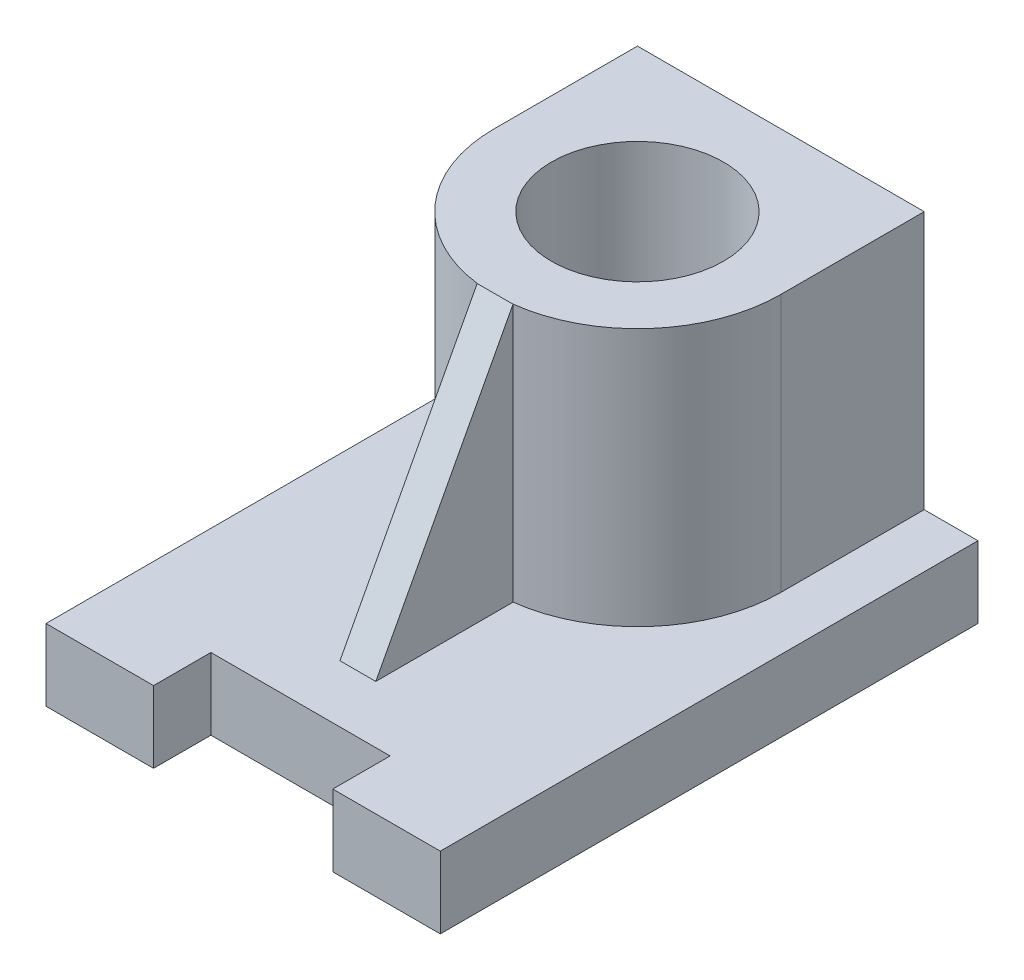
ISO-10303-21;
HEADER;
FILE_DESCRIPTION(('STEP AP214'),'2;1');
FILE_NAME('part.step','',(''),(''),'','','');
FILE_SCHEMA(('AUTOMOTIVE_DESIGN { 1 0 10303 214 1 1 1 1 }'));
ENDSEC;
DATA;
#1=APPLICATION_CONTEXT('core data for automotive mechanical design processes');
#2=APPLICATION_PROTOCOL_DEFINITION('international standard','automotive_design',2000,#1);
#3=PRODUCT_CONTEXT('',#1,'mechanical');
#4=PRODUCT('Part','Part','',(#3));
#5=PRODUCT_RELATED_PRODUCT_CATEGORY('part','',(#4));
#6=PRODUCT_DEFINITION_FORMATION('','',#4);
#7=PRODUCT_DEFINITION_CONTEXT('part definition',#1,'design');
#8=PRODUCT_DEFINITION('design','',#6,#7);
#9=PRODUCT_DEFINITION_SHAPE('','',#8);
#10=(LENGTH_UNIT() NAMED_UNIT(*) SI_UNIT(.MILLI.,.METRE.));
#11=(NAMED_UNIT(*) PLANE_ANGLE_UNIT() SI_UNIT($,.RADIAN.));
#12=(NAMED_UNIT(*) SI_UNIT($,.STERADIAN.) SOLID_ANGLE_UNIT());
#13=UNCERTAINTY_MEASURE_WITH_UNIT(LENGTH_MEASURE(1.E-05),#10,'distance_accuracy_value','');
#14=(GEOMETRIC_REPRESENTATION_CONTEXT(3) GLOBAL_UNCERTAINTY_ASSIGNED_CONTEXT((#13)) GLOBAL_UNIT_ASSIGNED_CONTEXT((#10,
#11,#12)) REPRESENTATION_CONTEXT('',''));
#15=CARTESIAN_POINT('',(0.,0.,0.));
#16=DIRECTION('',(0.,0.,1.));
#17=DIRECTION('',(1.,0.,0.));
#18=AXIS2_PLACEMENT_3D('',#15,#16,#17);
#19=CARTESIAN_POINT('',(0.,20.,-75.));
#20=DIRECTION('',(0.,1.,0.));
#21=DIRECTION('',(1.,0.,0.));
#22=AXIS2_PLACEMENT_3D('',#19,#20,#21);
#23=PLANE('',#22);
#24=DIRECTION('',(0.,0.,-1.));
#25=VECTOR('',#24,1.);
#26=CARTESIAN_POINT('',(40.,20.,-75.));
#27=LINE('',#26,#25);
#28=CARTESIAN_POINT('',(40.,20.,-110.));
#29=VERTEX_POINT('',#28);
#30=CARTESIAN_POINT('',(40.,20.,-150.));
#31=VERTEX_POINT('',#30);
#32=EDGE_CURVE('E10',#29,#31,#27,.T.);
#33=ORIENTED_EDGE('',*,*,#32,.F.);
#34=CARTESIAN_POINT('',(0.,20.,-110.));
#35=DIRECTION('',(0.,1.,0.));
#36=DIRECTION('',(1.,0.,0.));
#37=AXIS2_PLACEMENT_3D('',#34,#35,#36);
#38=CIRCLE('',#37,40.);
#39=CARTESIAN_POINT('',(5.,20.,-70.3137303340311));
#40=VERTEX_POINT('',#39);
#41=EDGE_CURVE('E24',#29,#40,#38,.F.);
#42=ORIENTED_EDGE('',*,*,#41,.T.);
#43=DIRECTION('',(0.,0.,-1.));
#44=VECTOR('',#43,1.);
#45=CARTESIAN_POINT('',(5.,20.,-75.));
#46=LINE('',#45,#44);
#47=CARTESIAN_POINT('',(5.,20.,-32.));
#48=VERTEX_POINT('',#47);
#49=EDGE_CURVE('E300',#48,#40,#46,.T.);
#50=ORIENTED_EDGE('',*,*,#49,.F.);
#51=DIRECTION('',(1.,0.,0.));
#52=VECTOR('',#51,1.);
#53=CARTESIAN_POINT('',(0.,20.,-32.));
#54=LINE('',#53,#52);
#55=CARTESIAN_POINT('',(-5.,20.,-32.));
#56=VERTEX_POINT('',#55);
#57=EDGE_CURVE('E297',#48,#56,#54,.F.);
#58=ORIENTED_EDGE('',*,*,#57,.T.);
#59=DIRECTION('',(0.,0.,-1.));
#60=VECTOR('',#59,1.);
#61=CARTESIAN_POINT('',(-5.,20.,-75.));
#62=LINE('',#61,#60);
#63=CARTESIAN_POINT('',(-5.,20.,-70.3137303340311));
#64=VERTEX_POINT('',#63);
#65=EDGE_CURVE('E294',#56,#64,#62,.T.);
#66=ORIENTED_EDGE('',*,*,#65,.T.);
#67=CARTESIAN_POINT('',(-40.,20.,-110.));
#68=VERTEX_POINT('',#67);
#69=EDGE_CURVE('E293',#64,#68,#38,.F.);
#70=ORIENTED_EDGE('',*,*,#69,.T.);
#71=DIRECTION('',(0.,0.,-1.));
#72=VECTOR('',#71,1.);
#73=CARTESIAN_POINT('',(-40.,20.,-75.));
#74=LINE('',#73,#72);
#75=CARTESIAN_POINT('',(-40.,20.,-150.));
#76=VERTEX_POINT('',#75);
#77=EDGE_CURVE('E154',#68,#76,#74,.T.);
#78=ORIENTED_EDGE('',*,*,#77,.T.);
#79=DIRECTION('',(1.,0.,0.));
#80=VECTOR('',#79,1.);
#81=CARTESIAN_POINT('',(47.5,20.,-150.));
#82=LINE('',#81,#80);
#83=CARTESIAN_POINT('',(-55.,20.,-150.));
#84=VERTEX_POINT('',#83);
#85=EDGE_CURVE('E287',#84,#76,#82,.T.);
#86=ORIENTED_EDGE('',*,*,#85,.F.);
#87=DIRECTION('',(0.,0.,1.));
#88=VECTOR('',#87,1.);
#89=CARTESIAN_POINT('',(-55.,20.,-75.));
#90=LINE('',#89,#88);
#91=CARTESIAN_POINT('',(-55.,20.,0.));
#92=VERTEX_POINT('',#91);
#93=EDGE_CURVE('E284',#84,#92,#90,.T.);
#94=ORIENTED_EDGE('',*,*,#93,.T.);
#95=DIRECTION('',(1.,0.,0.));
#96=VECTOR('',#95,1.);
#97=CARTESIAN_POINT('',(-40.,20.,0.));
#98=LINE('',#97,#96);
#99=CARTESIAN_POINT('',(-25.,20.,0.));
#100=VERTEX_POINT('',#99);
#101=EDGE_CURVE('E281',#92,#100,#98,.T.);
#102=ORIENTED_EDGE('',*,*,#101,.T.);
#103=DIRECTION('',(0.,0.,-1.));
#104=VECTOR('',#103,1.);
#105=CARTESIAN_POINT('',(-25.,20.,-8.));
#106=LINE('',#105,#104);
#107=CARTESIAN_POINT('',(-25.,20.,-16.));
#108=VERTEX_POINT('',#107);
#109=EDGE_CURVE('E278',#100,#108,#106,.T.);
#110=ORIENTED_EDGE('',*,*,#109,.T.);
#111=DIRECTION('',(1.,0.,0.));
#112=VECTOR('',#111,1.);
#113=CARTESIAN_POINT('',(0.,20.,-16.));
#114=LINE('',#113,#112);
#115=CARTESIAN_POINT('',(25.,20.,-16.));
#116=VERTEX_POINT('',#115);
#117=EDGE_CURVE('E275',#108,#116,#114,.T.);
#118=ORIENTED_EDGE('',*,*,#117,.T.);
#119=DIRECTION('',(0.,0.,1.));
#120=VECTOR('',#119,1.);
#121=CARTESIAN_POINT('',(25.,20.,-8.));
#122=LINE('',#121,#120);
#123=CARTESIAN_POINT('',(25.,20.,0.));
#124=VERTEX_POINT('',#123);
#125=EDGE_CURVE('E272',#116,#124,#122,.T.);
#126=ORIENTED_EDGE('',*,*,#125,.T.);
#127=DIRECTION('',(1.,0.,0.));
#128=VECTOR('',#127,1.);
#129=CARTESIAN_POINT('',(40.,20.,0.));
#130=LINE('',#129,#128);
#131=CARTESIAN_POINT('',(55.,20.,0.));
#132=VERTEX_POINT('',#131);
#133=EDGE_CURVE('E269',#124,#132,#130,.T.);
#134=ORIENTED_EDGE('',*,*,#133,.T.);
#135=DIRECTION('',(0.,0.,1.));
#136=VECTOR('',#135,1.);
#137=CARTESIAN_POINT('',(55.,20.,-75.));
#138=LINE('',#137,#136);
#139=CARTESIAN_POINT('',(55.,20.,-150.));
#140=VERTEX_POINT('',#139);
#141=EDGE_CURVE('E265',#140,#132,#138,.T.);
#142=ORIENTED_EDGE('',*,*,#141,.F.);
#143=EDGE_CURVE('E264',#31,#140,#82,.T.);
#144=ORIENTED_EDGE('',*,*,#143,.F.);
#145=EDGE_LOOP('',(#33,#42,#50,#58,#66,#70,#78,#86,#94,#102,#110,#118,#126,#134,#142,#144));
#146=FACE_BOUND('',#145,.T.);
#147=ADVANCED_FACE('F16',(#146),#23,.T.);
#148=CARTESIAN_POINT('',(47.5,20.,-150.));
#149=DIRECTION('',(0.,0.,-1.));
#150=DIRECTION('',(0.,1.,0.));
#151=AXIS2_PLACEMENT_3D('',#148,#149,#150);
#152=PLANE('',#151);
#153=DIRECTION('',(0.,-1.,0.));
#154=VECTOR('',#153,1.);
#155=CARTESIAN_POINT('',(55.,20.,-150.));
#156=LINE('',#155,#154);
#157=CARTESIAN_POINT('',(55.,0.,-150.));
#158=VERTEX_POINT('',#157);
#159=EDGE_CURVE('E261',#140,#158,#156,.T.);
#160=ORIENTED_EDGE('',*,*,#159,.T.);
#161=DIRECTION('',(1.,0.,0.));
#162=VECTOR('',#161,1.);
#163=CARTESIAN_POINT('',(47.5,0.,-150.));
#164=LINE('',#163,#162);
#165=CARTESIAN_POINT('',(-55.,0.,-150.));
#166=VERTEX_POINT('',#165);
#167=EDGE_CURVE('E257',#166,#158,#164,.T.);
#168=ORIENTED_EDGE('',*,*,#167,.F.);
#169=DIRECTION('',(0.,-1.,0.));
#170=VECTOR('',#169,1.);
#171=CARTESIAN_POINT('',(-55.,20.,-150.));
#172=LINE('',#171,#170);
#173=EDGE_CURVE('E253',#84,#166,#172,.T.);
#174=ORIENTED_EDGE('',*,*,#173,.F.);
#175=ORIENTED_EDGE('',*,*,#85,.T.);
#176=DIRECTION('',(0.,-1.,0.));
#177=VECTOR('',#176,1.);
#178=CARTESIAN_POINT('',(-40.,92.,-150.));
#179=LINE('',#178,#177);
#180=CARTESIAN_POINT('',(-40.,92.,-150.));
#181=VERTEX_POINT('',#180);
#182=EDGE_CURVE('E250',#181,#76,#179,.T.);
#183=ORIENTED_EDGE('',*,*,#182,.F.);
#184=DIRECTION('',(1.,0.,0.));
#185=VECTOR('',#184,1.);
#186=CARTESIAN_POINT('',(-20.,92.,-150.));
#187=LINE('',#186,#185);
#188=CARTESIAN_POINT('',(40.,92.,-150.));
#189=VERTEX_POINT('',#188);
#190=EDGE_CURVE('E134',#181,#189,#187,.T.);
#191=ORIENTED_EDGE('',*,*,#190,.T.);
#192=DIRECTION('',(0.,-1.,0.));
#193=VECTOR('',#192,1.);
#194=CARTESIAN_POINT('',(40.,92.,-150.));
#195=LINE('',#194,#193);
#196=EDGE_CURVE('E244',#189,#31,#195,.T.);
#197=ORIENTED_EDGE('',*,*,#196,.T.);
#198=ORIENTED_EDGE('',*,*,#143,.T.);
#199=EDGE_LOOP('',(#160,#168,#174,#175,#183,#191,#197,#198));
#200=FACE_BOUND('',#199,.T.);
#201=ADVANCED_FACE('F324',(#200),#152,.T.);
#202=CARTESIAN_POINT('',(-55.,20.,-75.));
#203=DIRECTION('',(1.,0.,0.));
#204=DIRECTION('',(0.,0.,-1.));
#205=AXIS2_PLACEMENT_3D('',#202,#203,#204);
#206=PLANE('',#205);
#207=DIRECTION('',(0.,0.,1.));
#208=VECTOR('',#207,1.);
#209=CARTESIAN_POINT('',(-55.,0.,-75.));
#210=LINE('',#209,#208);
#211=CARTESIAN_POINT('',(-55.,0.,0.));
#212=VERTEX_POINT('',#211);
#213=EDGE_CURVE('E241',#166,#212,#210,.T.);
#214=ORIENTED_EDGE('',*,*,#213,.T.);
#215=DIRECTION('',(0.,-1.,0.));
#216=VECTOR('',#215,1.);
#217=CARTESIAN_POINT('',(-55.,20.,0.));
#218=LINE('',#217,#216);
#219=EDGE_CURVE('E237',#92,#212,#218,.T.);
#220=ORIENTED_EDGE('',*,*,#219,.F.);
#221=ORIENTED_EDGE('',*,*,#93,.F.);
#222=ORIENTED_EDGE('',*,*,#173,.T.);
#223=EDGE_LOOP('',(#214,#220,#221,#222));
#224=FACE_BOUND('',#223,.T.);
#225=ADVANCED_FACE('F330',(#224),#206,.F.);
#226=CARTESIAN_POINT('',(-40.,20.,0.));
#227=DIRECTION('',(0.,0.,-1.));
#228=DIRECTION('',(0.,1.,0.));
#229=AXIS2_PLACEMENT_3D('',#226,#227,#228);
#230=PLANE('',#229);
#231=DIRECTION('',(1.,0.,0.));
#232=VECTOR('',#231,1.);
#233=CARTESIAN_POINT('',(-40.,0.,0.));
#234=LINE('',#233,#232);
#235=CARTESIAN_POINT('',(-25.,0.,0.));
#236=VERTEX_POINT('',#235);
#237=EDGE_CURVE('E234',#212,#236,#234,.T.);
#238=ORIENTED_EDGE('',*,*,#237,.T.);
#239=DIRECTION('',(0.,-1.,0.));
#240=VECTOR('',#239,1.);
#241=CARTESIAN_POINT('',(-25.,20.,0.));
#242=LINE('',#241,#240);
#243=EDGE_CURVE('E230',#100,#236,#242,.T.);
#244=ORIENTED_EDGE('',*,*,#243,.F.);
#245=ORIENTED_EDGE('',*,*,#101,.F.);
#246=ORIENTED_EDGE('',*,*,#219,.T.);
#247=EDGE_LOOP('',(#238,#244,#245,#246));
#248=FACE_BOUND('',#247,.T.);
#249=ADVANCED_FACE('F334',(#248),#230,.F.);
#250=CARTESIAN_POINT('',(-25.,20.,-8.));
#251=DIRECTION('',(-1.,0.,0.));
#252=DIRECTION('',(0.,1.,0.));
#253=AXIS2_PLACEMENT_3D('',#250,#251,#252);
#254=PLANE('',#253);
#255=DIRECTION('',(0.,0.,-1.));
#256=VECTOR('',#255,1.);
#257=CARTESIAN_POINT('',(-25.,0.,-8.));
#258=LINE('',#257,#256);
#259=CARTESIAN_POINT('',(-25.,0.,-16.));
#260=VERTEX_POINT('',#259);
#261=EDGE_CURVE('E227',#236,#260,#258,.T.);
#262=ORIENTED_EDGE('',*,*,#261,.T.);
#263=DIRECTION('',(0.,-1.,0.));
#264=VECTOR('',#263,1.);
#265=CARTESIAN_POINT('',(-25.,20.,-16.));
#266=LINE('',#265,#264);
#267=EDGE_CURVE('E223',#108,#260,#266,.T.);
#268=ORIENTED_EDGE('',*,*,#267,.F.);
#269=ORIENTED_EDGE('',*,*,#109,.F.);
#270=ORIENTED_EDGE('',*,*,#243,.T.);
#271=EDGE_LOOP('',(#262,#268,#269,#270));
#272=FACE_BOUND('',#271,.T.);
#273=ADVANCED_FACE('F339',(#272),#254,.F.);
#274=CARTESIAN_POINT('',(0.,20.,-16.));
#275=DIRECTION('',(0.,0.,-1.));
#276=DIRECTION('',(0.,1.,0.));
#277=AXIS2_PLACEMENT_3D('',#274,#275,#276);
#278=PLANE('',#277);
#279=DIRECTION('',(1.,0.,0.));
#280=VECTOR('',#279,1.);
#281=CARTESIAN_POINT('',(0.,0.,-16.));
#282=LINE('',#281,#280);
#283=CARTESIAN_POINT('',(25.,0.,-16.));
#284=VERTEX_POINT('',#283);
#285=EDGE_CURVE('E220',#260,#284,#282,.T.);
#286=ORIENTED_EDGE('',*,*,#285,.T.);
#287=DIRECTION('',(0.,-1.,0.));
#288=VECTOR('',#287,1.);
#289=CARTESIAN_POINT('',(25.,20.,-16.));
#290=LINE('',#289,#288);
#291=EDGE_CURVE('E216',#116,#284,#290,.T.);
#292=ORIENTED_EDGE('',*,*,#291,.F.);
#293=ORIENTED_EDGE('',*,*,#117,.F.);
#294=ORIENTED_EDGE('',*,*,#267,.T.);
#295=EDGE_LOOP('',(#286,#292,#293,#294));
#296=FACE_BOUND('',#295,.T.);
#297=ADVANCED_FACE('F345',(#296),#278,.F.);
#298=CARTESIAN_POINT('',(25.,20.,-8.));
#299=DIRECTION('',(1.,0.,0.));
#300=DIRECTION('',(0.,-1.,0.));
#301=AXIS2_PLACEMENT_3D('',#298,#299,#300);
#302=PLANE('',#301);
#303=DIRECTION('',(0.,0.,1.));
#304=VECTOR('',#303,1.);
#305=CARTESIAN_POINT('',(25.,0.,-8.));
#306=LINE('',#305,#304);
#307=CARTESIAN_POINT('',(25.,0.,0.));
#308=VERTEX_POINT('',#307);
#309=EDGE_CURVE('E213',#284,#308,#306,.T.);
#310=ORIENTED_EDGE('',*,*,#309,.T.);
#311=DIRECTION('',(0.,-1.,0.));
#312=VECTOR('',#311,1.);
#313=CARTESIAN_POINT('',(25.,20.,0.));
#314=LINE('',#313,#312);
#315=EDGE_CURVE('E209',#124,#308,#314,.T.);
#316=ORIENTED_EDGE('',*,*,#315,.F.);
#317=ORIENTED_EDGE('',*,*,#125,.F.);
#318=ORIENTED_EDGE('',*,*,#291,.T.);
#319=EDGE_LOOP('',(#310,#316,#317,#318));
#320=FACE_BOUND('',#319,.T.);
#321=ADVANCED_FACE('F349',(#320),#302,.F.);
#322=CARTESIAN_POINT('',(40.,20.,0.));
#323=DIRECTION('',(0.,0.,-1.));
#324=DIRECTION('',(0.,1.,0.));
#325=AXIS2_PLACEMENT_3D('',#322,#323,#324);
#326=PLANE('',#325);
#327=DIRECTION('',(1.,0.,0.));
#328=VECTOR('',#327,1.);
#329=CARTESIAN_POINT('',(40.,0.,0.));
#330=LINE('',#329,#328);
#331=CARTESIAN_POINT('',(55.,0.,0.));
#332=VERTEX_POINT('',#331);
#333=EDGE_CURVE('E206',#308,#332,#330,.T.);
#334=ORIENTED_EDGE('',*,*,#333,.T.);
#335=DIRECTION('',(0.,-1.,0.));
#336=VECTOR('',#335,1.);
#337=CARTESIAN_POINT('',(55.,20.,0.));
#338=LINE('',#337,#336);
#339=EDGE_CURVE('E202',#132,#332,#338,.T.);
#340=ORIENTED_EDGE('',*,*,#339,.F.);
#341=ORIENTED_EDGE('',*,*,#133,.F.);
#342=ORIENTED_EDGE('',*,*,#315,.T.);
#343=EDGE_LOOP('',(#334,#340,#341,#342));
#344=FACE_BOUND('',#343,.T.);
#345=ADVANCED_FACE('F354',(#344),#326,.F.);
#346=CARTESIAN_POINT('',(55.,20.,-75.));
#347=DIRECTION('',(1.,0.,0.));
#348=DIRECTION('',(0.,0.,-1.));
#349=AXIS2_PLACEMENT_3D('',#346,#347,#348);
#350=PLANE('',#349);
#351=DIRECTION('',(0.,0.,1.));
#352=VECTOR('',#351,1.);
#353=CARTESIAN_POINT('',(55.,0.,-75.));
#354=LINE('',#353,#352);
#355=EDGE_CURVE('E198',#158,#332,#354,.T.);
#356=ORIENTED_EDGE('',*,*,#355,.F.);
#357=ORIENTED_EDGE('',*,*,#159,.F.);
#358=ORIENTED_EDGE('',*,*,#141,.T.);
#359=ORIENTED_EDGE('',*,*,#339,.T.);
#360=EDGE_LOOP('',(#356,#357,#358,#359));
#361=FACE_BOUND('',#360,.T.);
#362=ADVANCED_FACE('F359',(#361),#350,.T.);
#363=CARTESIAN_POINT('',(0.,20.,-110.));
#364=DIRECTION('',(0.,-1.,0.));
#365=DIRECTION('',(-1.,0.,0.));
#366=AXIS2_PLACEMENT_3D('',#363,#364,#365);
#367=CYLINDRICAL_SURFACE('',#366,24.);
#368=CARTESIAN_POINT('',(0.,0.,-110.));
#369=DIRECTION('',(0.,1.,0.));
#370=DIRECTION('',(1.,0.,0.));
#371=AXIS2_PLACEMENT_3D('',#368,#369,#370);
#372=CIRCLE('',#371,24.);
#373=CARTESIAN_POINT('',(24.,0.,-110.));
#374=VERTEX_POINT('',#373);
#375=EDGE_CURVE('E194',#374,#374,#372,.T.);
#376=ORIENTED_EDGE('',*,*,#375,.F.);
#377=EDGE_LOOP('',(#376));
#378=FACE_BOUND('',#377,.T.);
#379=CARTESIAN_POINT('',(0.,92.,-110.));
#380=DIRECTION('',(0.,1.,0.));
#381=DIRECTION('',(1.,0.,0.));
#382=AXIS2_PLACEMENT_3D('',#379,#380,#381);
#383=CIRCLE('',#382,24.);
#384=CARTESIAN_POINT('',(24.,92.,-110.));
#385=VERTEX_POINT('',#384);
#386=EDGE_CURVE('E190',#385,#385,#383,.T.);
#387=ORIENTED_EDGE('',*,*,#386,.T.);
#388=EDGE_LOOP('',(#387));
#389=FACE_BOUND('',#388,.T.);
#390=ADVANCED_FACE('F364',(#378,#389),#367,.F.);
#391=CARTESIAN_POINT('',(0.,0.,-75.));
#392=DIRECTION('',(0.,1.,0.));
#393=DIRECTION('',(1.,0.,0.));
#394=AXIS2_PLACEMENT_3D('',#391,#392,#393);
#395=PLANE('',#394);
#396=ORIENTED_EDGE('',*,*,#167,.T.);
#397=ORIENTED_EDGE('',*,*,#355,.T.);
#398=ORIENTED_EDGE('',*,*,#333,.F.);
#399=ORIENTED_EDGE('',*,*,#309,.F.);
#400=ORIENTED_EDGE('',*,*,#285,.F.);
#401=ORIENTED_EDGE('',*,*,#261,.F.);
#402=ORIENTED_EDGE('',*,*,#237,.F.);
#403=ORIENTED_EDGE('',*,*,#213,.F.);
#404=EDGE_LOOP('',(#396,#397,#398,#399,#400,#401,#402,#403));
#405=FACE_BOUND('',#404,.T.);
#406=ORIENTED_EDGE('',*,*,#375,.T.);
#407=EDGE_LOOP('',(#406));
#408=FACE_BOUND('',#407,.T.);
#409=ADVANCED_FACE('F361',(#405,#408),#395,.F.);
#410=CARTESIAN_POINT('',(-5.,92.,-51.1568651670156));
#411=DIRECTION('',(1.,0.,0.));
#412=DIRECTION('',(0.,0.,-1.));
#413=AXIS2_PLACEMENT_3D('',#410,#411,#412);
#414=PLANE('',#413);
#415=ORIENTED_EDGE('',*,*,#65,.F.);
#416=DIRECTION('',(0.,0.882946773475131,-0.469473103819438));
#417=VECTOR('',#416,1.);
#418=CARTESIAN_POINT('',(-5.,20.,-32.));
#419=LINE('',#418,#417);
#420=CARTESIAN_POINT('',(-5.,92.,-70.2832402704868));
#421=VERTEX_POINT('',#420);
#422=EDGE_CURVE('E186',#421,#56,#419,.F.);
#423=ORIENTED_EDGE('',*,*,#422,.F.);
#424=DIRECTION('',(0.,0.,1.));
#425=VECTOR('',#424,1.);
#426=CARTESIAN_POINT('',(-5.,92.,-51.1568651670156));
#427=LINE('',#426,#425);
#428=CARTESIAN_POINT('',(-5.,92.,-70.3137303340311));
#429=VERTEX_POINT('',#428);
#430=EDGE_CURVE('E183',#429,#421,#427,.T.);
#431=ORIENTED_EDGE('',*,*,#430,.F.);
#432=DIRECTION('',(0.,-1.,0.));
#433=VECTOR('',#432,1.);
#434=CARTESIAN_POINT('',(-5.,92.,-70.3137303340311));
#435=LINE('',#434,#433);
#436=EDGE_CURVE('E148',#429,#64,#435,.T.);
#437=ORIENTED_EDGE('',*,*,#436,.T.);
#438=EDGE_LOOP('',(#415,#423,#431,#437));
#439=FACE_BOUND('',#438,.T.);
#440=ADVANCED_FACE('F310',(#439),#414,.F.);
#441=CARTESIAN_POINT('',(0.,20.,-32.));
#442=DIRECTION('',(0.,0.469473103819438,0.882946773475131));
#443=DIRECTION('',(0.,0.882946773475131,-0.469473103819437));
#444=AXIS2_PLACEMENT_3D('',#441,#442,#443);
#445=PLANE('',#444);
#446=ORIENTED_EDGE('',*,*,#57,.F.);
#447=DIRECTION('',(0.,0.882946773475131,-0.469473103819438));
#448=VECTOR('',#447,1.);
#449=CARTESIAN_POINT('',(5.,20.,-32.));
#450=LINE('',#449,#448);
#451=CARTESIAN_POINT('',(5.,92.,-70.2832402704868));
#452=VERTEX_POINT('',#451);
#453=EDGE_CURVE('E177',#452,#48,#450,.F.);
#454=ORIENTED_EDGE('',*,*,#453,.F.);
#455=DIRECTION('',(-1.,0.,0.));
#456=VECTOR('',#455,1.);
#457=CARTESIAN_POINT('',(0.,92.,-70.2832402704868));
#458=LINE('',#457,#456);
#459=EDGE_CURVE('E173',#421,#452,#458,.F.);
#460=ORIENTED_EDGE('',*,*,#459,.F.);
#461=ORIENTED_EDGE('',*,*,#422,.T.);
#462=EDGE_LOOP('',(#446,#454,#460,#461));
#463=FACE_BOUND('',#462,.T.);
#464=ADVANCED_FACE('F314',(#463),#445,.T.);
#465=CARTESIAN_POINT('',(5.,92.,-51.1568651670156));
#466=DIRECTION('',(1.,0.,0.));
#467=DIRECTION('',(0.,0.,-1.));
#468=AXIS2_PLACEMENT_3D('',#465,#466,#467);
#469=PLANE('',#468);
#470=ORIENTED_EDGE('',*,*,#453,.T.);
#471=ORIENTED_EDGE('',*,*,#49,.T.);
#472=DIRECTION('',(0.,-1.,0.));
#473=VECTOR('',#472,1.);
#474=CARTESIAN_POINT('',(5.,92.,-70.3137303340311));
#475=LINE('',#474,#473);
#476=CARTESIAN_POINT('',(5.,92.,-70.3137303340311));
#477=VERTEX_POINT('',#476);
#478=EDGE_CURVE('E169',#477,#40,#475,.T.);
#479=ORIENTED_EDGE('',*,*,#478,.F.);
#480=DIRECTION('',(0.,0.,1.));
#481=VECTOR('',#480,1.);
#482=CARTESIAN_POINT('',(5.,92.,-51.1568651670156));
#483=LINE('',#482,#481);
#484=EDGE_CURVE('E165',#477,#452,#483,.T.);
#485=ORIENTED_EDGE('',*,*,#484,.T.);
#486=EDGE_LOOP('',(#470,#471,#479,#485));
#487=FACE_BOUND('',#486,.T.);
#488=ADVANCED_FACE('F316',(#487),#469,.T.);
#489=CARTESIAN_POINT('',(0.,92.,-75.));
#490=DIRECTION('',(0.,1.,0.));
#491=DIRECTION('',(1.,0.,0.));
#492=AXIS2_PLACEMENT_3D('',#489,#490,#491);
#493=PLANE('',#492);
#494=ORIENTED_EDGE('',*,*,#484,.F.);
#495=CARTESIAN_POINT('',(0.,92.,-110.));
#496=DIRECTION('',(0.,1.,0.));
#497=DIRECTION('',(1.,0.,0.));
#498=AXIS2_PLACEMENT_3D('',#495,#496,#497);
#499=CIRCLE('',#498,40.);
#500=CARTESIAN_POINT('',(40.,92.,-110.));
#501=VERTEX_POINT('',#500);
#502=EDGE_CURVE('E152',#477,#501,#499,.T.);
#503=ORIENTED_EDGE('',*,*,#502,.T.);
#504=DIRECTION('',(0.,0.,1.));
#505=VECTOR('',#504,1.);
#506=CARTESIAN_POINT('',(40.,92.,-130.));
#507=LINE('',#506,#505);
#508=EDGE_CURVE('E139',#189,#501,#507,.T.);
#509=ORIENTED_EDGE('',*,*,#508,.F.);
#510=ORIENTED_EDGE('',*,*,#190,.F.);
#511=DIRECTION('',(0.,0.,1.));
#512=VECTOR('',#511,1.);
#513=CARTESIAN_POINT('',(-40.,92.,-130.));
#514=LINE('',#513,#512);
#515=CARTESIAN_POINT('',(-40.,92.,-110.));
#516=VERTEX_POINT('',#515);
#517=EDGE_CURVE('E125',#181,#516,#514,.T.);
#518=ORIENTED_EDGE('',*,*,#517,.T.);
#519=EDGE_CURVE('E131',#516,#429,#499,.T.);
#520=ORIENTED_EDGE('',*,*,#519,.T.);
#521=ORIENTED_EDGE('',*,*,#430,.T.);
#522=ORIENTED_EDGE('',*,*,#459,.T.);
#523=EDGE_LOOP('',(#494,#503,#509,#510,#518,#520,#521,#522));
#524=FACE_BOUND('',#523,.T.);
#525=ORIENTED_EDGE('',*,*,#386,.F.);
#526=EDGE_LOOP('',(#525));
#527=FACE_BOUND('',#526,.T.);
#528=ADVANCED_FACE('F128',(#524,#527),#493,.T.);
#529=CARTESIAN_POINT('',(0.,92.,-110.));
#530=DIRECTION('',(0.,-1.,0.));
#531=DIRECTION('',(-1.,0.,0.));
#532=AXIS2_PLACEMENT_3D('',#529,#530,#531);
#533=CYLINDRICAL_SURFACE('',#532,40.);
#534=ORIENTED_EDGE('',*,*,#502,.F.);
#535=ORIENTED_EDGE('',*,*,#478,.T.);
#536=ORIENTED_EDGE('',*,*,#41,.F.);
#537=DIRECTION('',(0.,-1.,0.));
#538=VECTOR('',#537,1.);
#539=CARTESIAN_POINT('',(40.,92.,-110.));
#540=LINE('',#539,#538);
#541=EDGE_CURVE('E150',#501,#29,#540,.T.);
#542=ORIENTED_EDGE('',*,*,#541,.F.);
#543=EDGE_LOOP('',(#534,#535,#536,#542));
#544=FACE_BOUND('',#543,.T.);
#545=ADVANCED_FACE('F318',(#544),#533,.T.);
#546=ORIENTED_EDGE('',*,*,#69,.F.);
#547=ORIENTED_EDGE('',*,*,#436,.F.);
#548=ORIENTED_EDGE('',*,*,#519,.F.);
#549=DIRECTION('',(0.,-1.,0.));
#550=VECTOR('',#549,1.);
#551=CARTESIAN_POINT('',(-40.,92.,-110.));
#552=LINE('',#551,#550);
#553=EDGE_CURVE('E145',#516,#68,#552,.T.);
#554=ORIENTED_EDGE('',*,*,#553,.T.);
#555=EDGE_LOOP('',(#546,#547,#548,#554));
#556=FACE_BOUND('',#555,.T.);
#557=ADVANCED_FACE('F144',(#556),#533,.T.);
#558=CARTESIAN_POINT('',(40.,92.,-130.));
#559=DIRECTION('',(1.,0.,0.));
#560=DIRECTION('',(0.,-1.,0.));
#561=AXIS2_PLACEMENT_3D('',#558,#559,#560);
#562=PLANE('',#561);
#563=ORIENTED_EDGE('',*,*,#541,.T.);
#564=ORIENTED_EDGE('',*,*,#32,.T.);
#565=ORIENTED_EDGE('',*,*,#196,.F.);
#566=ORIENTED_EDGE('',*,*,#508,.T.);
#567=EDGE_LOOP('',(#563,#564,#565,#566));
#568=FACE_BOUND('',#567,.T.);
#569=ADVANCED_FACE('F440',(#568),#562,.T.);
#570=CARTESIAN_POINT('',(-40.,92.,-130.));
#571=DIRECTION('',(1.,0.,0.));
#572=DIRECTION('',(0.,-1.,0.));
#573=AXIS2_PLACEMENT_3D('',#570,#571,#572);
#574=PLANE('',#573);
#575=ORIENTED_EDGE('',*,*,#77,.F.);
#576=ORIENTED_EDGE('',*,*,#553,.F.);
#577=ORIENTED_EDGE('',*,*,#517,.F.);
#578=ORIENTED_EDGE('',*,*,#182,.T.);
#579=EDGE_LOOP('',(#575,#576,#577,#578));
#580=FACE_BOUND('',#579,.T.);
#581=ADVANCED_FACE('F153',(#580),#574,.F.);
#582=CLOSED_SHELL('',(#147,#201,#225,#249,#273,#297,#321,#345,#362,#390,#409,#440,#464,#488,
#528,#545,#557,#569,#581));
#583=MANIFOLD_SOLID_BREP('B1',#582);
#584=ADVANCED_BREP_SHAPE_REPRESENTATION('',(#18,#583),#14);
#585=SHAPE_DEFINITION_REPRESENTATION(#9,#584);
ENDSEC;
END-ISO-10303-21;
